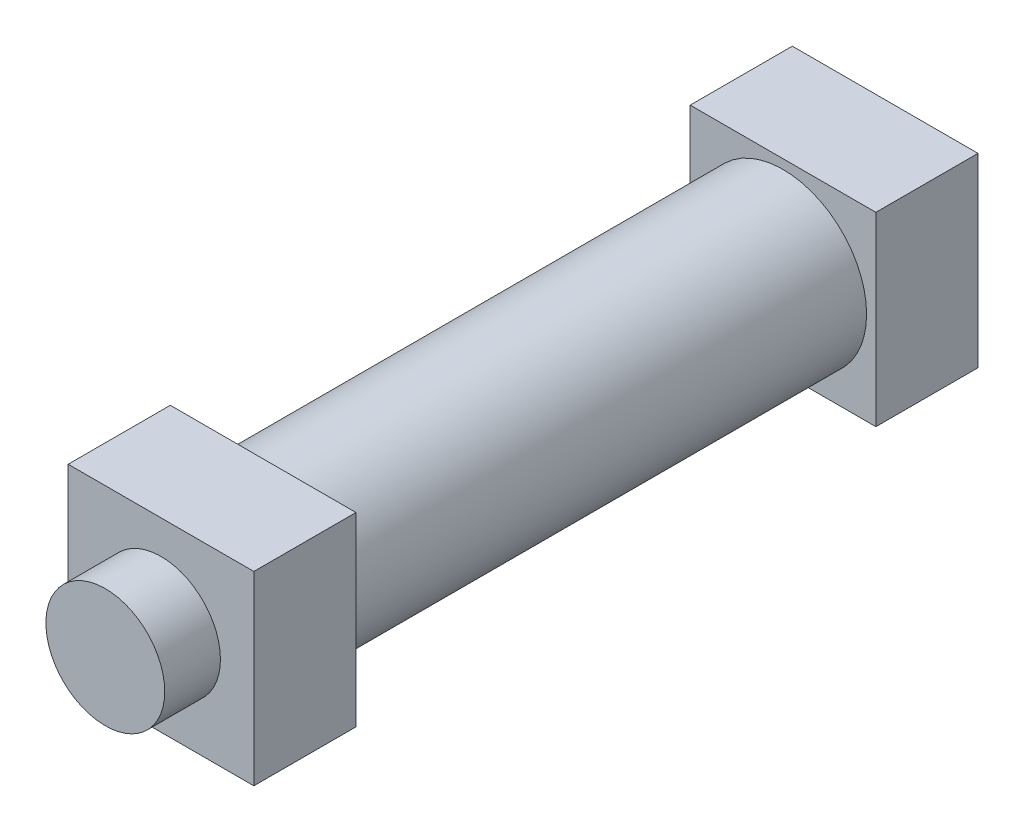
ISO-10303-21;
HEADER;
FILE_DESCRIPTION(('STEP AP214'),'2;1');
FILE_NAME('part.step','',(''),(''),'','','');
FILE_SCHEMA(('AUTOMOTIVE_DESIGN { 1 0 10303 214 1 1 1 1 }'));
ENDSEC;
DATA;
#1=APPLICATION_CONTEXT('core data for automotive mechanical design processes');
#2=APPLICATION_PROTOCOL_DEFINITION('international standard','automotive_design',2000,#1);
#3=PRODUCT_CONTEXT('',#1,'mechanical');
#4=PRODUCT('Part','Part','',(#3));
#5=PRODUCT_RELATED_PRODUCT_CATEGORY('part','',(#4));
#6=PRODUCT_DEFINITION_FORMATION('','',#4);
#7=PRODUCT_DEFINITION_CONTEXT('part definition',#1,'design');
#8=PRODUCT_DEFINITION('design','',#6,#7);
#9=PRODUCT_DEFINITION_SHAPE('','',#8);
#10=(LENGTH_UNIT() NAMED_UNIT(*) SI_UNIT(.MILLI.,.METRE.));
#11=(NAMED_UNIT(*) PLANE_ANGLE_UNIT() SI_UNIT($,.RADIAN.));
#12=(NAMED_UNIT(*) SI_UNIT($,.STERADIAN.) SOLID_ANGLE_UNIT());
#13=UNCERTAINTY_MEASURE_WITH_UNIT(LENGTH_MEASURE(1.E-05),#10,'distance_accuracy_value','');
#14=(GEOMETRIC_REPRESENTATION_CONTEXT(3) GLOBAL_UNCERTAINTY_ASSIGNED_CONTEXT((#13)) GLOBAL_UNIT_ASSIGNED_CONTEXT((#10,
#11,#12)) REPRESENTATION_CONTEXT('',''));
#15=CARTESIAN_POINT('',(0.,0.,0.));
#16=DIRECTION('',(0.,0.,1.));
#17=DIRECTION('',(1.,0.,0.));
#18=AXIS2_PLACEMENT_3D('',#15,#16,#17);
#19=CARTESIAN_POINT('',(0.,0.,27.5));
#20=DIRECTION('',(1.,0.,0.));
#21=DIRECTION('',(0.,0.,-1.));
#22=AXIS2_PLACEMENT_3D('',#19,#20,#21);
#23=PLANE('',#22);
#24=DIRECTION('',(0.,-1.,0.));
#25=VECTOR('',#24,1.);
#26=CARTESIAN_POINT('',(0.,0.,0.));
#27=LINE('',#26,#25);
#28=CARTESIAN_POINT('',(0.,50.,0.));
#29=VERTEX_POINT('',#28);
#30=CARTESIAN_POINT('',(0.,0.,0.));
#31=VERTEX_POINT('',#30);
#32=EDGE_CURVE('E139',#29,#31,#27,.T.);
#33=ORIENTED_EDGE('',*,*,#32,.T.);
#34=DIRECTION('',(0.,0.,-1.));
#35=VECTOR('',#34,1.);
#36=CARTESIAN_POINT('',(0.,0.,27.5));
#37=LINE('',#36,#35);
#38=CARTESIAN_POINT('',(0.,0.,27.5));
#39=VERTEX_POINT('',#38);
#40=EDGE_CURVE('E37',#39,#31,#37,.T.);
#41=ORIENTED_EDGE('',*,*,#40,.F.);
#42=DIRECTION('',(0.,-1.,0.));
#43=VECTOR('',#42,1.);
#44=CARTESIAN_POINT('',(0.,0.,27.5));
#45=LINE('',#44,#43);
#46=CARTESIAN_POINT('',(0.,50.,27.5));
#47=VERTEX_POINT('',#46);
#48=EDGE_CURVE('E147',#47,#39,#45,.T.);
#49=ORIENTED_EDGE('',*,*,#48,.F.);
#50=DIRECTION('',(0.,0.,-1.));
#51=VECTOR('',#50,1.);
#52=CARTESIAN_POINT('',(0.,50.,27.5));
#53=LINE('',#52,#51);
#54=EDGE_CURVE('E153',#47,#29,#53,.T.);
#55=ORIENTED_EDGE('',*,*,#54,.T.);
#56=EDGE_LOOP('',(#33,#41,#49,#55));
#57=FACE_BOUND('',#56,.T.);
#58=ADVANCED_FACE('F34',(#57),#23,.F.);
#59=CARTESIAN_POINT('',(0.,0.,27.5));
#60=DIRECTION('',(0.,1.,0.));
#61=DIRECTION('',(0.,0.,1.));
#62=AXIS2_PLACEMENT_3D('',#59,#60,#61);
#63=PLANE('',#62);
#64=DIRECTION('',(1.,0.,0.));
#65=VECTOR('',#64,1.);
#66=CARTESIAN_POINT('',(0.,0.,0.));
#67=LINE('',#66,#65);
#68=CARTESIAN_POINT('',(50.,0.,0.));
#69=VERTEX_POINT('',#68);
#70=EDGE_CURVE('E156',#31,#69,#67,.T.);
#71=ORIENTED_EDGE('',*,*,#70,.T.);
#72=DIRECTION('',(0.,0.,-1.));
#73=VECTOR('',#72,1.);
#74=CARTESIAN_POINT('',(50.,0.,27.5));
#75=LINE('',#74,#73);
#76=CARTESIAN_POINT('',(50.,0.,27.5));
#77=VERTEX_POINT('',#76);
#78=EDGE_CURVE('E162',#77,#69,#75,.T.);
#79=ORIENTED_EDGE('',*,*,#78,.F.);
#80=DIRECTION('',(1.,0.,0.));
#81=VECTOR('',#80,1.);
#82=CARTESIAN_POINT('',(0.,0.,27.5));
#83=LINE('',#82,#81);
#84=EDGE_CURVE('E84',#39,#77,#83,.T.);
#85=ORIENTED_EDGE('',*,*,#84,.F.);
#86=ORIENTED_EDGE('',*,*,#40,.T.);
#87=EDGE_LOOP('',(#71,#79,#85,#86));
#88=FACE_BOUND('',#87,.T.);
#89=ADVANCED_FACE('F165',(#88),#63,.F.);
#90=CARTESIAN_POINT('',(50.,0.,27.5));
#91=DIRECTION('',(-1.,0.,0.));
#92=DIRECTION('',(0.,0.,1.));
#93=AXIS2_PLACEMENT_3D('',#90,#91,#92);
#94=PLANE('',#93);
#95=DIRECTION('',(0.,1.,0.));
#96=VECTOR('',#95,1.);
#97=CARTESIAN_POINT('',(50.,0.,0.));
#98=LINE('',#97,#96);
#99=CARTESIAN_POINT('',(50.,50.,0.));
#100=VERTEX_POINT('',#99);
#101=EDGE_CURVE('E70',#69,#100,#98,.T.);
#102=ORIENTED_EDGE('',*,*,#101,.T.);
#103=DIRECTION('',(0.,0.,-1.));
#104=VECTOR('',#103,1.);
#105=CARTESIAN_POINT('',(50.,50.,27.5));
#106=LINE('',#105,#104);
#107=CARTESIAN_POINT('',(50.,50.,27.5));
#108=VERTEX_POINT('',#107);
#109=EDGE_CURVE('E161',#108,#100,#106,.T.);
#110=ORIENTED_EDGE('',*,*,#109,.F.);
#111=DIRECTION('',(0.,1.,0.));
#112=VECTOR('',#111,1.);
#113=CARTESIAN_POINT('',(50.,0.,27.5));
#114=LINE('',#113,#112);
#115=EDGE_CURVE('E150',#77,#108,#114,.T.);
#116=ORIENTED_EDGE('',*,*,#115,.F.);
#117=ORIENTED_EDGE('',*,*,#78,.T.);
#118=EDGE_LOOP('',(#102,#110,#116,#117));
#119=FACE_BOUND('',#118,.T.);
#120=ADVANCED_FACE('F189',(#119),#94,.F.);
#121=CARTESIAN_POINT('',(0.,50.,27.5));
#122=DIRECTION('',(0.,-1.,0.));
#123=DIRECTION('',(0.,0.,-1.));
#124=AXIS2_PLACEMENT_3D('',#121,#122,#123);
#125=PLANE('',#124);
#126=DIRECTION('',(-1.,0.,0.));
#127=VECTOR('',#126,1.);
#128=CARTESIAN_POINT('',(0.,50.,0.));
#129=LINE('',#128,#127);
#130=EDGE_CURVE('E76',#100,#29,#129,.T.);
#131=ORIENTED_EDGE('',*,*,#130,.T.);
#132=ORIENTED_EDGE('',*,*,#54,.F.);
#133=DIRECTION('',(-1.,0.,0.));
#134=VECTOR('',#133,1.);
#135=CARTESIAN_POINT('',(0.,50.,27.5));
#136=LINE('',#135,#134);
#137=EDGE_CURVE('E52',#108,#47,#136,.T.);
#138=ORIENTED_EDGE('',*,*,#137,.F.);
#139=ORIENTED_EDGE('',*,*,#109,.T.);
#140=EDGE_LOOP('',(#131,#132,#138,#139));
#141=FACE_BOUND('',#140,.T.);
#142=ADVANCED_FACE('F181',(#141),#125,.F.);
#143=CARTESIAN_POINT('',(0.,0.,27.5));
#144=DIRECTION('',(0.,0.,-1.));
#145=DIRECTION('',(-1.,0.,0.));
#146=AXIS2_PLACEMENT_3D('',#143,#144,#145);
#147=PLANE('',#146);
#148=CARTESIAN_POINT('',(25.,25.,27.5));
#149=DIRECTION('',(0.,0.,1.));
#150=DIRECTION('',(1.,0.,0.));
#151=AXIS2_PLACEMENT_3D('',#148,#149,#150);
#152=CIRCLE('',#151,22.5);
#153=CARTESIAN_POINT('',(47.5,25.,27.5));
#154=VERTEX_POINT('',#153);
#155=EDGE_CURVE('E43',#154,#154,#152,.T.);
#156=ORIENTED_EDGE('',*,*,#155,.F.);
#157=EDGE_LOOP('',(#156));
#158=FACE_BOUND('',#157,.T.);
#159=ORIENTED_EDGE('',*,*,#48,.T.);
#160=ORIENTED_EDGE('',*,*,#84,.T.);
#161=ORIENTED_EDGE('',*,*,#115,.T.);
#162=ORIENTED_EDGE('',*,*,#137,.T.);
#163=EDGE_LOOP('',(#159,#160,#161,#162));
#164=FACE_BOUND('',#163,.T.);
#165=ADVANCED_FACE('F173',(#158,#164),#147,.F.);
#166=CARTESIAN_POINT('',(0.,0.,0.));
#167=DIRECTION('',(0.,0.,-1.));
#168=DIRECTION('',(-1.,0.,0.));
#169=AXIS2_PLACEMENT_3D('',#166,#167,#168);
#170=PLANE('',#169);
#171=ORIENTED_EDGE('',*,*,#32,.F.);
#172=ORIENTED_EDGE('',*,*,#130,.F.);
#173=ORIENTED_EDGE('',*,*,#101,.F.);
#174=ORIENTED_EDGE('',*,*,#70,.F.);
#175=EDGE_LOOP('',(#171,#172,#173,#174));
#176=FACE_BOUND('',#175,.T.);
#177=ADVANCED_FACE('F170',(#176),#170,.T.);
#178=CARTESIAN_POINT('',(25.,25.,167.5));
#179=DIRECTION('',(0.,0.,-1.));
#180=DIRECTION('',(-1.,0.,0.));
#181=AXIS2_PLACEMENT_3D('',#178,#179,#180);
#182=CYLINDRICAL_SURFACE('',#181,22.5);
#183=CARTESIAN_POINT('',(25.,25.,167.5));
#184=DIRECTION('',(0.,0.,1.));
#185=DIRECTION('',(1.,0.,0.));
#186=AXIS2_PLACEMENT_3D('',#183,#184,#185);
#187=CIRCLE('',#186,22.5);
#188=CARTESIAN_POINT('',(47.5,25.,167.5));
#189=VERTEX_POINT('',#188);
#190=EDGE_CURVE('E136',#189,#189,#187,.T.);
#191=ORIENTED_EDGE('',*,*,#190,.F.);
#192=EDGE_LOOP('',(#191));
#193=FACE_BOUND('',#192,.T.);
#194=ORIENTED_EDGE('',*,*,#155,.T.);
#195=EDGE_LOOP('',(#194));
#196=FACE_BOUND('',#195,.T.);
#197=ADVANCED_FACE('F172',(#193,#196),#182,.T.);
#198=CARTESIAN_POINT('',(0.,0.,195.));
#199=DIRECTION('',(1.,0.,0.));
#200=DIRECTION('',(0.,0.,-1.));
#201=AXIS2_PLACEMENT_3D('',#198,#199,#200);
#202=PLANE('',#201);
#203=DIRECTION('',(0.,-1.,0.));
#204=VECTOR('',#203,1.);
#205=CARTESIAN_POINT('',(0.,0.,167.5));
#206=LINE('',#205,#204);
#207=CARTESIAN_POINT('',(0.,50.,167.5));
#208=VERTEX_POINT('',#207);
#209=CARTESIAN_POINT('',(0.,0.,167.5));
#210=VERTEX_POINT('',#209);
#211=EDGE_CURVE('E135',#208,#210,#206,.T.);
#212=ORIENTED_EDGE('',*,*,#211,.T.);
#213=DIRECTION('',(0.,0.,-1.));
#214=VECTOR('',#213,1.);
#215=CARTESIAN_POINT('',(0.,0.,195.));
#216=LINE('',#215,#214);
#217=CARTESIAN_POINT('',(0.,0.,195.));
#218=VERTEX_POINT('',#217);
#219=EDGE_CURVE('E115',#218,#210,#216,.T.);
#220=ORIENTED_EDGE('',*,*,#219,.F.);
#221=DIRECTION('',(0.,-1.,0.));
#222=VECTOR('',#221,1.);
#223=CARTESIAN_POINT('',(0.,0.,195.));
#224=LINE('',#223,#222);
#225=CARTESIAN_POINT('',(0.,50.,195.));
#226=VERTEX_POINT('',#225);
#227=EDGE_CURVE('E122',#226,#218,#224,.T.);
#228=ORIENTED_EDGE('',*,*,#227,.F.);
#229=DIRECTION('',(0.,0.,-1.));
#230=VECTOR('',#229,1.);
#231=CARTESIAN_POINT('',(0.,50.,195.));
#232=LINE('',#231,#230);
#233=EDGE_CURVE('E299',#226,#208,#232,.T.);
#234=ORIENTED_EDGE('',*,*,#233,.T.);
#235=EDGE_LOOP('',(#212,#220,#228,#234));
#236=FACE_BOUND('',#235,.T.);
#237=ADVANCED_FACE('F133',(#236),#202,.F.);
#238=CARTESIAN_POINT('',(0.,0.,195.));
#239=DIRECTION('',(0.,1.,0.));
#240=DIRECTION('',(0.,0.,1.));
#241=AXIS2_PLACEMENT_3D('',#238,#239,#240);
#242=PLANE('',#241);
#243=DIRECTION('',(1.,0.,0.));
#244=VECTOR('',#243,1.);
#245=CARTESIAN_POINT('',(0.,0.,167.5));
#246=LINE('',#245,#244);
#247=CARTESIAN_POINT('',(50.,0.,167.5));
#248=VERTEX_POINT('',#247);
#249=EDGE_CURVE('E295',#210,#248,#246,.T.);
#250=ORIENTED_EDGE('',*,*,#249,.T.);
#251=DIRECTION('',(0.,0.,-1.));
#252=VECTOR('',#251,1.);
#253=CARTESIAN_POINT('',(50.,0.,195.));
#254=LINE('',#253,#252);
#255=CARTESIAN_POINT('',(50.,0.,195.));
#256=VERTEX_POINT('',#255);
#257=EDGE_CURVE('E118',#256,#248,#254,.T.);
#258=ORIENTED_EDGE('',*,*,#257,.F.);
#259=DIRECTION('',(1.,0.,0.));
#260=VECTOR('',#259,1.);
#261=CARTESIAN_POINT('',(0.,0.,195.));
#262=LINE('',#261,#260);
#263=EDGE_CURVE('E111',#218,#256,#262,.T.);
#264=ORIENTED_EDGE('',*,*,#263,.F.);
#265=ORIENTED_EDGE('',*,*,#219,.T.);
#266=EDGE_LOOP('',(#250,#258,#264,#265));
#267=FACE_BOUND('',#266,.T.);
#268=ADVANCED_FACE('F113',(#267),#242,.F.);
#269=CARTESIAN_POINT('',(50.,0.,195.));
#270=DIRECTION('',(-1.,0.,0.));
#271=DIRECTION('',(0.,0.,1.));
#272=AXIS2_PLACEMENT_3D('',#269,#270,#271);
#273=PLANE('',#272);
#274=DIRECTION('',(0.,1.,0.));
#275=VECTOR('',#274,1.);
#276=CARTESIAN_POINT('',(50.,0.,167.5));
#277=LINE('',#276,#275);
#278=CARTESIAN_POINT('',(50.,50.,167.5));
#279=VERTEX_POINT('',#278);
#280=EDGE_CURVE('E302',#248,#279,#277,.T.);
#281=ORIENTED_EDGE('',*,*,#280,.T.);
#282=DIRECTION('',(0.,0.,-1.));
#283=VECTOR('',#282,1.);
#284=CARTESIAN_POINT('',(50.,50.,195.));
#285=LINE('',#284,#283);
#286=CARTESIAN_POINT('',(50.,50.,195.));
#287=VERTEX_POINT('',#286);
#288=EDGE_CURVE('E141',#287,#279,#285,.T.);
#289=ORIENTED_EDGE('',*,*,#288,.F.);
#290=DIRECTION('',(0.,1.,0.));
#291=VECTOR('',#290,1.);
#292=CARTESIAN_POINT('',(50.,0.,195.));
#293=LINE('',#292,#291);
#294=EDGE_CURVE('E121',#256,#287,#293,.T.);
#295=ORIENTED_EDGE('',*,*,#294,.F.);
#296=ORIENTED_EDGE('',*,*,#257,.T.);
#297=EDGE_LOOP('',(#281,#289,#295,#296));
#298=FACE_BOUND('',#297,.T.);
#299=ADVANCED_FACE('F229',(#298),#273,.F.);
#300=CARTESIAN_POINT('',(0.,50.,195.));
#301=DIRECTION('',(0.,-1.,0.));
#302=DIRECTION('',(0.,0.,-1.));
#303=AXIS2_PLACEMENT_3D('',#300,#301,#302);
#304=PLANE('',#303);
#305=DIRECTION('',(-1.,0.,0.));
#306=VECTOR('',#305,1.);
#307=CARTESIAN_POINT('',(0.,50.,167.5));
#308=LINE('',#307,#306);
#309=EDGE_CURVE('E131',#279,#208,#308,.T.);
#310=ORIENTED_EDGE('',*,*,#309,.T.);
#311=ORIENTED_EDGE('',*,*,#233,.F.);
#312=DIRECTION('',(-1.,0.,0.));
#313=VECTOR('',#312,1.);
#314=CARTESIAN_POINT('',(0.,50.,195.));
#315=LINE('',#314,#313);
#316=EDGE_CURVE('E127',#287,#226,#315,.T.);
#317=ORIENTED_EDGE('',*,*,#316,.F.);
#318=ORIENTED_EDGE('',*,*,#288,.T.);
#319=EDGE_LOOP('',(#310,#311,#317,#318));
#320=FACE_BOUND('',#319,.T.);
#321=ADVANCED_FACE('F238',(#320),#304,.F.);
#322=CARTESIAN_POINT('',(0.,0.,195.));
#323=DIRECTION('',(0.,0.,-1.));
#324=DIRECTION('',(-1.,0.,0.));
#325=AXIS2_PLACEMENT_3D('',#322,#323,#324);
#326=PLANE('',#325);
#327=CARTESIAN_POINT('',(25.,25.,195.));
#328=DIRECTION('',(0.,0.,1.));
#329=DIRECTION('',(1.,0.,0.));
#330=AXIS2_PLACEMENT_3D('',#327,#328,#329);
#331=CIRCLE('',#330,16.);
#332=CARTESIAN_POINT('',(41.,25.,195.));
#333=VERTEX_POINT('',#332);
#334=EDGE_CURVE('E11',#333,#333,#331,.T.);
#335=ORIENTED_EDGE('',*,*,#334,.F.);
#336=EDGE_LOOP('',(#335));
#337=FACE_BOUND('',#336,.T.);
#338=ORIENTED_EDGE('',*,*,#227,.T.);
#339=ORIENTED_EDGE('',*,*,#263,.T.);
#340=ORIENTED_EDGE('',*,*,#294,.T.);
#341=ORIENTED_EDGE('',*,*,#316,.T.);
#342=EDGE_LOOP('',(#338,#339,#340,#341));
#343=FACE_BOUND('',#342,.T.);
#344=ADVANCED_FACE('F125',(#337,#343),#326,.F.);
#345=CARTESIAN_POINT('',(0.,0.,167.5));
#346=DIRECTION('',(0.,0.,-1.));
#347=DIRECTION('',(-1.,0.,0.));
#348=AXIS2_PLACEMENT_3D('',#345,#346,#347);
#349=PLANE('',#348);
#350=ORIENTED_EDGE('',*,*,#190,.T.);
#351=EDGE_LOOP('',(#350));
#352=FACE_BOUND('',#351,.T.);
#353=ORIENTED_EDGE('',*,*,#211,.F.);
#354=ORIENTED_EDGE('',*,*,#309,.F.);
#355=ORIENTED_EDGE('',*,*,#280,.F.);
#356=ORIENTED_EDGE('',*,*,#249,.F.);
#357=EDGE_LOOP('',(#353,#354,#355,#356));
#358=FACE_BOUND('',#357,.T.);
#359=ADVANCED_FACE('F255',(#352,#358),#349,.T.);
#360=CARTESIAN_POINT('',(25.,25.,210.));
#361=DIRECTION('',(0.,0.,-1.));
#362=DIRECTION('',(-1.,0.,0.));
#363=AXIS2_PLACEMENT_3D('',#360,#361,#362);
#364=CYLINDRICAL_SURFACE('',#363,16.);
#365=CARTESIAN_POINT('',(25.,25.,210.));
#366=DIRECTION('',(0.,0.,1.));
#367=DIRECTION('',(1.,0.,0.));
#368=AXIS2_PLACEMENT_3D('',#365,#366,#367);
#369=CIRCLE('',#368,16.);
#370=CARTESIAN_POINT('',(41.,25.,210.));
#371=VERTEX_POINT('',#370);
#372=EDGE_CURVE('E293',#371,#371,#369,.T.);
#373=ORIENTED_EDGE('',*,*,#372,.F.);
#374=EDGE_LOOP('',(#373));
#375=FACE_BOUND('',#374,.T.);
#376=ORIENTED_EDGE('',*,*,#334,.T.);
#377=EDGE_LOOP('',(#376));
#378=FACE_BOUND('',#377,.T.);
#379=ADVANCED_FACE('F260',(#375,#378),#364,.T.);
#380=CARTESIAN_POINT('',(25.,25.,210.));
#381=DIRECTION('',(0.,0.,1.));
#382=DIRECTION('',(1.,0.,0.));
#383=AXIS2_PLACEMENT_3D('',#380,#381,#382);
#384=PLANE('',#383);
#385=ORIENTED_EDGE('',*,*,#372,.T.);
#386=EDGE_LOOP('',(#385));
#387=FACE_BOUND('',#386,.T.);
#388=ADVANCED_FACE('F277',(#387),#384,.T.);
#389=CLOSED_SHELL('',(#58,#89,#120,#142,#165,#177,#197,#237,#268,#299,#321,#344,#359,#379,#388));
#390=MANIFOLD_SOLID_BREP('B2',#389);
#391=ADVANCED_BREP_SHAPE_REPRESENTATION('',(#18,#390),#14);
#392=SHAPE_DEFINITION_REPRESENTATION(#9,#391);
ENDSEC;
END-ISO-10303-21;
